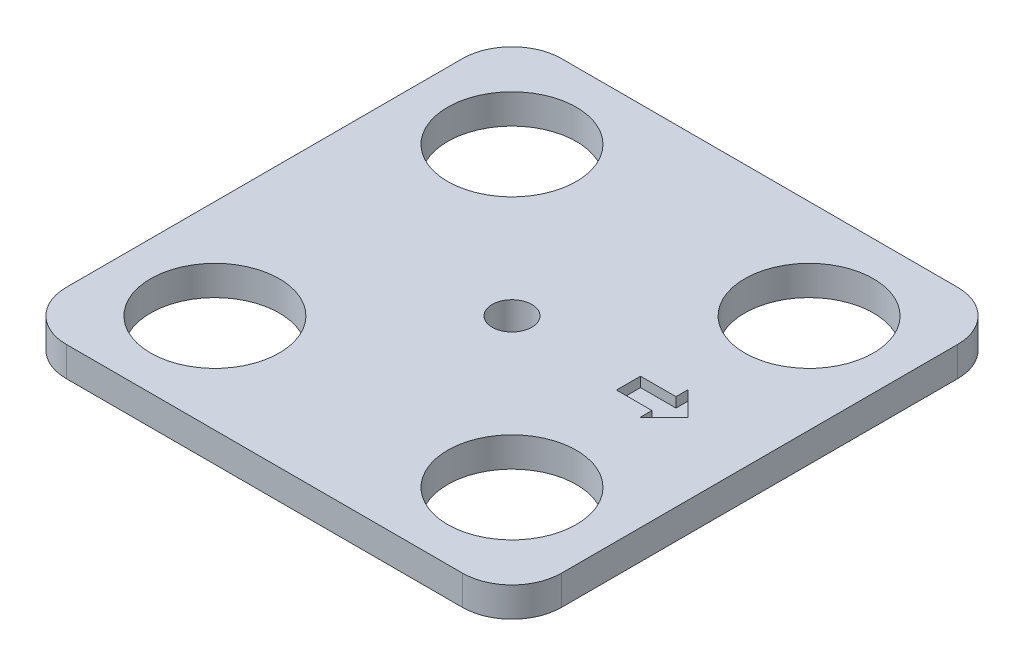
ISO-10303-21;
HEADER;
FILE_DESCRIPTION(('STEP AP214'),'2;1');
FILE_NAME('part.step','',(''),(''),'','','');
FILE_SCHEMA(('AUTOMOTIVE_DESIGN { 1 0 10303 214 1 1 1 1 }'));
ENDSEC;
DATA;
#1=APPLICATION_CONTEXT('core data for automotive mechanical design processes');
#2=APPLICATION_PROTOCOL_DEFINITION('international standard','automotive_design',2000,#1);
#3=PRODUCT_CONTEXT('',#1,'mechanical');
#4=PRODUCT('Part','Part','',(#3));
#5=PRODUCT_RELATED_PRODUCT_CATEGORY('part','',(#4));
#6=PRODUCT_DEFINITION_FORMATION('','',#4);
#7=PRODUCT_DEFINITION_CONTEXT('part definition',#1,'design');
#8=PRODUCT_DEFINITION('design','',#6,#7);
#9=PRODUCT_DEFINITION_SHAPE('','',#8);
#10=(LENGTH_UNIT() NAMED_UNIT(*) SI_UNIT(.MILLI.,.METRE.));
#11=(NAMED_UNIT(*) PLANE_ANGLE_UNIT() SI_UNIT($,.RADIAN.));
#12=(NAMED_UNIT(*) SI_UNIT($,.STERADIAN.) SOLID_ANGLE_UNIT());
#13=UNCERTAINTY_MEASURE_WITH_UNIT(LENGTH_MEASURE(1.E-05),#10,'distance_accuracy_value','');
#14=(GEOMETRIC_REPRESENTATION_CONTEXT(3) GLOBAL_UNCERTAINTY_ASSIGNED_CONTEXT((#13)) GLOBAL_UNIT_ASSIGNED_CONTEXT((#10,
#11,#12)) REPRESENTATION_CONTEXT('',''));
#15=CARTESIAN_POINT('',(0.,0.,0.));
#16=DIRECTION('',(0.,0.,1.));
#17=DIRECTION('',(1.,0.,0.));
#18=AXIS2_PLACEMENT_3D('',#15,#16,#17);
#19=CARTESIAN_POINT('',(-250.,30.,250.));
#20=DIRECTION('',(1.,0.,0.));
#21=DIRECTION('',(0.,0.,-1.));
#22=AXIS2_PLACEMENT_3D('',#19,#20,#21);
#23=PLANE('',#22);
#24=DIRECTION('',(0.,0.,1.));
#25=VECTOR('',#24,1.);
#26=CARTESIAN_POINT('',(-250.,30.,250.));
#27=LINE('',#26,#25);
#28=CARTESIAN_POINT('',(-250.,30.,-200.));
#29=VERTEX_POINT('',#28);
#30=CARTESIAN_POINT('',(-250.,30.,200.));
#31=VERTEX_POINT('',#30);
#32=EDGE_CURVE('E269',#29,#31,#27,.T.);
#33=ORIENTED_EDGE('',*,*,#32,.F.);
#34=DIRECTION('',(0.,-1.,0.));
#35=VECTOR('',#34,1.);
#36=CARTESIAN_POINT('',(-250.,30.,-200.));
#37=LINE('',#36,#35);
#38=CARTESIAN_POINT('',(-250.,0.,-200.));
#39=VERTEX_POINT('',#38);
#40=EDGE_CURVE('E339',#29,#39,#37,.T.);
#41=ORIENTED_EDGE('',*,*,#40,.T.);
#42=DIRECTION('',(0.,0.,1.));
#43=VECTOR('',#42,1.);
#44=CARTESIAN_POINT('',(-250.,0.,250.));
#45=LINE('',#44,#43);
#46=CARTESIAN_POINT('',(-250.,0.,200.));
#47=VERTEX_POINT('',#46);
#48=EDGE_CURVE('E265',#39,#47,#45,.T.);
#49=ORIENTED_EDGE('',*,*,#48,.T.);
#50=DIRECTION('',(0.,-1.,0.));
#51=VECTOR('',#50,1.);
#52=CARTESIAN_POINT('',(-250.,30.,200.));
#53=LINE('',#52,#51);
#54=EDGE_CURVE('E336',#47,#31,#53,.F.);
#55=ORIENTED_EDGE('',*,*,#54,.T.);
#56=EDGE_LOOP('',(#33,#41,#49,#55));
#57=FACE_BOUND('',#56,.T.);
#58=ADVANCED_FACE('F40',(#57),#23,.F.);
#59=CARTESIAN_POINT('',(250.,30.,250.));
#60=DIRECTION('',(0.,0.,-1.));
#61=DIRECTION('',(-1.,0.,0.));
#62=AXIS2_PLACEMENT_3D('',#59,#60,#61);
#63=PLANE('',#62);
#64=DIRECTION('',(1.,0.,0.));
#65=VECTOR('',#64,1.);
#66=CARTESIAN_POINT('',(250.,30.,250.));
#67=LINE('',#66,#65);
#68=CARTESIAN_POINT('',(-200.,30.,250.));
#69=VERTEX_POINT('',#68);
#70=CARTESIAN_POINT('',(200.,30.,250.));
#71=VERTEX_POINT('',#70);
#72=EDGE_CURVE('E273',#69,#71,#67,.T.);
#73=ORIENTED_EDGE('',*,*,#72,.F.);
#74=DIRECTION('',(0.,-1.,0.));
#75=VECTOR('',#74,1.);
#76=CARTESIAN_POINT('',(-200.,30.,250.));
#77=LINE('',#76,#75);
#78=CARTESIAN_POINT('',(-200.,0.,250.));
#79=VERTEX_POINT('',#78);
#80=EDGE_CURVE('E11',#69,#79,#77,.T.);
#81=ORIENTED_EDGE('',*,*,#80,.T.);
#82=DIRECTION('',(1.,0.,0.));
#83=VECTOR('',#82,1.);
#84=CARTESIAN_POINT('',(250.,0.,250.));
#85=LINE('',#84,#83);
#86=CARTESIAN_POINT('',(200.,0.,250.));
#87=VERTEX_POINT('',#86);
#88=EDGE_CURVE('E289',#79,#87,#85,.T.);
#89=ORIENTED_EDGE('',*,*,#88,.T.);
#90=DIRECTION('',(0.,-1.,0.));
#91=VECTOR('',#90,1.);
#92=CARTESIAN_POINT('',(200.,30.,250.));
#93=LINE('',#92,#91);
#94=EDGE_CURVE('E49',#87,#71,#93,.F.);
#95=ORIENTED_EDGE('',*,*,#94,.T.);
#96=EDGE_LOOP('',(#73,#81,#89,#95));
#97=FACE_BOUND('',#96,.T.);
#98=ADVANCED_FACE('F358',(#97),#63,.F.);
#99=CARTESIAN_POINT('',(250.,30.,250.));
#100=DIRECTION('',(-1.,0.,0.));
#101=DIRECTION('',(0.,0.,1.));
#102=AXIS2_PLACEMENT_3D('',#99,#100,#101);
#103=PLANE('',#102);
#104=DIRECTION('',(0.,0.,-1.));
#105=VECTOR('',#104,1.);
#106=CARTESIAN_POINT('',(250.,0.,250.));
#107=LINE('',#106,#105);
#108=CARTESIAN_POINT('',(250.,0.,200.));
#109=VERTEX_POINT('',#108);
#110=CARTESIAN_POINT('',(250.,0.,-200.));
#111=VERTEX_POINT('',#110);
#112=EDGE_CURVE('E292',#109,#111,#107,.T.);
#113=ORIENTED_EDGE('',*,*,#112,.T.);
#114=DIRECTION('',(0.,-1.,0.));
#115=VECTOR('',#114,1.);
#116=CARTESIAN_POINT('',(250.,30.,-200.));
#117=LINE('',#116,#115);
#118=CARTESIAN_POINT('',(250.,30.,-200.));
#119=VERTEX_POINT('',#118);
#120=EDGE_CURVE('E321',#111,#119,#117,.F.);
#121=ORIENTED_EDGE('',*,*,#120,.T.);
#122=DIRECTION('',(0.,0.,-1.));
#123=VECTOR('',#122,1.);
#124=CARTESIAN_POINT('',(250.,30.,250.));
#125=LINE('',#124,#123);
#126=CARTESIAN_POINT('',(250.,30.,200.));
#127=VERTEX_POINT('',#126);
#128=EDGE_CURVE('E277',#127,#119,#125,.T.);
#129=ORIENTED_EDGE('',*,*,#128,.F.);
#130=DIRECTION('',(0.,-1.,0.));
#131=VECTOR('',#130,1.);
#132=CARTESIAN_POINT('',(250.,30.,200.));
#133=LINE('',#132,#131);
#134=EDGE_CURVE('E317',#127,#109,#133,.T.);
#135=ORIENTED_EDGE('',*,*,#134,.T.);
#136=EDGE_LOOP('',(#113,#121,#129,#135));
#137=FACE_BOUND('',#136,.T.);
#138=ADVANCED_FACE('F367',(#137),#103,.F.);
#139=CARTESIAN_POINT('',(250.,30.,-250.));
#140=DIRECTION('',(0.,0.,1.));
#141=DIRECTION('',(1.,0.,0.));
#142=AXIS2_PLACEMENT_3D('',#139,#140,#141);
#143=PLANE('',#142);
#144=DIRECTION('',(-1.,0.,0.));
#145=VECTOR('',#144,1.);
#146=CARTESIAN_POINT('',(250.,30.,-250.));
#147=LINE('',#146,#145);
#148=CARTESIAN_POINT('',(200.,30.,-250.));
#149=VERTEX_POINT('',#148);
#150=CARTESIAN_POINT('',(-200.,30.,-250.));
#151=VERTEX_POINT('',#150);
#152=EDGE_CURVE('E281',#149,#151,#147,.T.);
#153=ORIENTED_EDGE('',*,*,#152,.F.);
#154=DIRECTION('',(0.,-1.,0.));
#155=VECTOR('',#154,1.);
#156=CARTESIAN_POINT('',(200.,30.,-250.));
#157=LINE('',#156,#155);
#158=CARTESIAN_POINT('',(200.,0.,-250.));
#159=VERTEX_POINT('',#158);
#160=EDGE_CURVE('E301',#149,#159,#157,.T.);
#161=ORIENTED_EDGE('',*,*,#160,.T.);
#162=DIRECTION('',(-1.,0.,0.));
#163=VECTOR('',#162,1.);
#164=CARTESIAN_POINT('',(250.,0.,-250.));
#165=LINE('',#164,#163);
#166=CARTESIAN_POINT('',(-200.,0.,-250.));
#167=VERTEX_POINT('',#166);
#168=EDGE_CURVE('E274',#159,#167,#165,.T.);
#169=ORIENTED_EDGE('',*,*,#168,.T.);
#170=DIRECTION('',(0.,-1.,0.));
#171=VECTOR('',#170,1.);
#172=CARTESIAN_POINT('',(-200.,30.,-250.));
#173=LINE('',#172,#171);
#174=EDGE_CURVE('E285',#167,#151,#173,.F.);
#175=ORIENTED_EDGE('',*,*,#174,.T.);
#176=EDGE_LOOP('',(#153,#161,#169,#175));
#177=FACE_BOUND('',#176,.T.);
#178=ADVANCED_FACE('F375',(#177),#143,.F.);
#179=CARTESIAN_POINT('',(0.,30.,0.));
#180=DIRECTION('',(0.,1.,0.));
#181=DIRECTION('',(0.,0.,1.));
#182=AXIS2_PLACEMENT_3D('',#179,#180,#181);
#183=PLANE('',#182);
#184=CARTESIAN_POINT('',(0.,30.,0.));
#185=DIRECTION('',(0.,1.,0.));
#186=DIRECTION('',(0.,0.,1.));
#187=AXIS2_PLACEMENT_3D('',#184,#185,#186);
#188=CIRCLE('',#187,20.);
#189=CARTESIAN_POINT('',(0.,30.,20.));
#190=VERTEX_POINT('',#189);
#191=EDGE_CURVE('E180',#190,#190,#188,.T.);
#192=ORIENTED_EDGE('',*,*,#191,.F.);
#193=EDGE_LOOP('',(#192));
#194=FACE_BOUND('',#193,.T.);
#195=DIRECTION('',(0.707106781186551,0.,-0.707106781186544));
#196=VECTOR('',#195,1.);
#197=CARTESIAN_POINT('',(177.720371549238,30.,0.));
#198=LINE('',#197,#196);
#199=CARTESIAN_POINT('',(153.455288688315,30.,24.2650828609228));
#200=VERTEX_POINT('',#199);
#201=CARTESIAN_POINT('',(177.720371549238,30.,0.));
#202=VERTEX_POINT('',#201);
#203=EDGE_CURVE('E56',#200,#202,#198,.T.);
#204=ORIENTED_EDGE('',*,*,#203,.F.);
#205=DIRECTION('',(0.,0.,1.));
#206=VECTOR('',#205,1.);
#207=CARTESIAN_POINT('',(153.455288688315,30.,24.2650828609228));
#208=LINE('',#207,#206);
#209=CARTESIAN_POINT('',(153.455288688315,30.,12.1325414304614));
#210=VERTEX_POINT('',#209);
#211=EDGE_CURVE('E173',#210,#200,#208,.T.);
#212=ORIENTED_EDGE('',*,*,#211,.F.);
#213=DIRECTION('',(1.,0.,0.));
#214=VECTOR('',#213,1.);
#215=CARTESIAN_POINT('',(153.455288688315,30.,12.1325414304614));
#216=LINE('',#215,#214);
#217=CARTESIAN_POINT('',(117.643810745868,30.,12.1325414304614));
#218=VERTEX_POINT('',#217);
#219=EDGE_CURVE('E177',#218,#210,#216,.T.);
#220=ORIENTED_EDGE('',*,*,#219,.F.);
#221=DIRECTION('',(0.,0.,1.));
#222=VECTOR('',#221,1.);
#223=CARTESIAN_POINT('',(117.643810745868,30.,-12.1325414304614));
#224=LINE('',#223,#222);
#225=CARTESIAN_POINT('',(117.643810745868,30.,-12.1325414304614));
#226=VERTEX_POINT('',#225);
#227=EDGE_CURVE('E212',#226,#218,#224,.T.);
#228=ORIENTED_EDGE('',*,*,#227,.F.);
#229=DIRECTION('',(-1.,0.,0.));
#230=VECTOR('',#229,1.);
#231=CARTESIAN_POINT('',(153.455288688315,30.,-12.1325414304614));
#232=LINE('',#231,#230);
#233=CARTESIAN_POINT('',(153.455288688315,30.,-12.1325414304614));
#234=VERTEX_POINT('',#233);
#235=EDGE_CURVE('E208',#234,#226,#232,.T.);
#236=ORIENTED_EDGE('',*,*,#235,.F.);
#237=DIRECTION('',(0.,0.,1.));
#238=VECTOR('',#237,1.);
#239=CARTESIAN_POINT('',(153.455288688315,30.,-24.2650828609228));
#240=LINE('',#239,#238);
#241=CARTESIAN_POINT('',(153.455288688315,30.,-24.2650828609228));
#242=VERTEX_POINT('',#241);
#243=EDGE_CURVE('E204',#242,#234,#240,.T.);
#244=ORIENTED_EDGE('',*,*,#243,.F.);
#245=DIRECTION('',(-0.707106781186551,0.,-0.707106781186544));
#246=VECTOR('',#245,1.);
#247=CARTESIAN_POINT('',(177.720371549238,30.,0.));
#248=LINE('',#247,#246);
#249=EDGE_CURVE('E200',#202,#242,#248,.T.);
#250=ORIENTED_EDGE('',*,*,#249,.F.);
#251=EDGE_LOOP('',(#204,#212,#220,#228,#236,#244,#250));
#252=FACE_BOUND('',#251,.T.);
#253=CARTESIAN_POINT('',(-150.,30.,150.));
#254=DIRECTION('',(0.,1.,0.));
#255=DIRECTION('',(0.,0.,1.));
#256=AXIS2_PLACEMENT_3D('',#253,#254,#255);
#257=CIRCLE('',#256,65.);
#258=CARTESIAN_POINT('',(-150.,30.,215.));
#259=VERTEX_POINT('',#258);
#260=EDGE_CURVE('E250',#259,#259,#257,.T.);
#261=ORIENTED_EDGE('',*,*,#260,.F.);
#262=EDGE_LOOP('',(#261));
#263=FACE_BOUND('',#262,.T.);
#264=CARTESIAN_POINT('',(150.,30.,-150.));
#265=DIRECTION('',(0.,1.,0.));
#266=DIRECTION('',(0.,0.,1.));
#267=AXIS2_PLACEMENT_3D('',#264,#265,#266);
#268=CIRCLE('',#267,65.);
#269=CARTESIAN_POINT('',(150.,30.,-85.));
#270=VERTEX_POINT('',#269);
#271=EDGE_CURVE('E241',#270,#270,#268,.T.);
#272=ORIENTED_EDGE('',*,*,#271,.F.);
#273=EDGE_LOOP('',(#272));
#274=FACE_BOUND('',#273,.T.);
#275=CARTESIAN_POINT('',(-150.,30.,-150.));
#276=DIRECTION('',(0.,1.,0.));
#277=DIRECTION('',(0.,0.,1.));
#278=AXIS2_PLACEMENT_3D('',#275,#276,#277);
#279=CIRCLE('',#278,65.);
#280=CARTESIAN_POINT('',(-150.,30.,-85.));
#281=VERTEX_POINT('',#280);
#282=EDGE_CURVE('E222',#281,#281,#279,.T.);
#283=ORIENTED_EDGE('',*,*,#282,.F.);
#284=EDGE_LOOP('',(#283));
#285=FACE_BOUND('',#284,.T.);
#286=CARTESIAN_POINT('',(150.,30.,150.));
#287=DIRECTION('',(0.,1.,0.));
#288=DIRECTION('',(0.,0.,1.));
#289=AXIS2_PLACEMENT_3D('',#286,#287,#288);
#290=CIRCLE('',#289,65.0000000000001);
#291=CARTESIAN_POINT('',(150.,30.,215.));
#292=VERTEX_POINT('',#291);
#293=EDGE_CURVE('E249',#292,#292,#290,.T.);
#294=ORIENTED_EDGE('',*,*,#293,.F.);
#295=EDGE_LOOP('',(#294));
#296=FACE_BOUND('',#295,.T.);
#297=ORIENTED_EDGE('',*,*,#128,.T.);
#298=CARTESIAN_POINT('',(200.,30.,-200.));
#299=DIRECTION('',(0.,1.,0.));
#300=DIRECTION('',(0.,0.,1.));
#301=AXIS2_PLACEMENT_3D('',#298,#299,#300);
#302=CIRCLE('',#301,50.);
#303=EDGE_CURVE('E333',#119,#149,#302,.T.);
#304=ORIENTED_EDGE('',*,*,#303,.T.);
#305=ORIENTED_EDGE('',*,*,#152,.T.);
#306=CARTESIAN_POINT('',(-200.,30.,-200.));
#307=DIRECTION('',(0.,1.,0.));
#308=DIRECTION('',(0.,0.,1.));
#309=AXIS2_PLACEMENT_3D('',#306,#307,#308);
#310=CIRCLE('',#309,50.);
#311=EDGE_CURVE('E330',#151,#29,#310,.T.);
#312=ORIENTED_EDGE('',*,*,#311,.T.);
#313=ORIENTED_EDGE('',*,*,#32,.T.);
#314=CARTESIAN_POINT('',(-200.,30.,200.));
#315=DIRECTION('',(0.,1.,0.));
#316=DIRECTION('',(0.,0.,1.));
#317=AXIS2_PLACEMENT_3D('',#314,#315,#316);
#318=CIRCLE('',#317,50.);
#319=EDGE_CURVE('E327',#31,#69,#318,.T.);
#320=ORIENTED_EDGE('',*,*,#319,.T.);
#321=ORIENTED_EDGE('',*,*,#72,.T.);
#322=CARTESIAN_POINT('',(200.,30.,200.));
#323=DIRECTION('',(0.,1.,0.));
#324=DIRECTION('',(0.,0.,1.));
#325=AXIS2_PLACEMENT_3D('',#322,#323,#324);
#326=CIRCLE('',#325,50.);
#327=EDGE_CURVE('E324',#71,#127,#326,.T.);
#328=ORIENTED_EDGE('',*,*,#327,.T.);
#329=EDGE_LOOP('',(#297,#304,#305,#312,#313,#320,#321,#328));
#330=FACE_BOUND('',#329,.T.);
#331=ADVANCED_FACE('F361',(#194,#252,#263,#274,#285,#296,#330),#183,.T.);
#332=CARTESIAN_POINT('',(0.,0.,0.));
#333=DIRECTION('',(0.,1.,0.));
#334=DIRECTION('',(0.,0.,1.));
#335=AXIS2_PLACEMENT_3D('',#332,#333,#334);
#336=PLANE('',#335);
#337=CARTESIAN_POINT('',(0.,0.,0.));
#338=DIRECTION('',(0.,1.,0.));
#339=DIRECTION('',(0.,0.,1.));
#340=AXIS2_PLACEMENT_3D('',#337,#338,#339);
#341=CIRCLE('',#340,20.);
#342=CARTESIAN_POINT('',(0.,0.,20.));
#343=VERTEX_POINT('',#342);
#344=EDGE_CURVE('E201',#343,#343,#341,.T.);
#345=ORIENTED_EDGE('',*,*,#344,.T.);
#346=EDGE_LOOP('',(#345));
#347=FACE_BOUND('',#346,.T.);
#348=CARTESIAN_POINT('',(-150.,0.,150.));
#349=DIRECTION('',(0.,1.,0.));
#350=DIRECTION('',(0.,0.,1.));
#351=AXIS2_PLACEMENT_3D('',#348,#349,#350);
#352=CIRCLE('',#351,65.);
#353=CARTESIAN_POINT('',(-150.,0.,215.));
#354=VERTEX_POINT('',#353);
#355=EDGE_CURVE('E245',#354,#354,#352,.T.);
#356=ORIENTED_EDGE('',*,*,#355,.T.);
#357=EDGE_LOOP('',(#356));
#358=FACE_BOUND('',#357,.T.);
#359=CARTESIAN_POINT('',(150.,0.,-150.));
#360=DIRECTION('',(0.,1.,0.));
#361=DIRECTION('',(0.,0.,1.));
#362=AXIS2_PLACEMENT_3D('',#359,#360,#361);
#363=CIRCLE('',#362,65.);
#364=CARTESIAN_POINT('',(150.,0.,-85.));
#365=VERTEX_POINT('',#364);
#366=EDGE_CURVE('E254',#365,#365,#363,.T.);
#367=ORIENTED_EDGE('',*,*,#366,.T.);
#368=EDGE_LOOP('',(#367));
#369=FACE_BOUND('',#368,.T.);
#370=CARTESIAN_POINT('',(-150.,0.,-150.));
#371=DIRECTION('',(0.,1.,0.));
#372=DIRECTION('',(0.,0.,1.));
#373=AXIS2_PLACEMENT_3D('',#370,#371,#372);
#374=CIRCLE('',#373,65.);
#375=CARTESIAN_POINT('',(-150.,0.,-85.));
#376=VERTEX_POINT('',#375);
#377=EDGE_CURVE('E237',#376,#376,#374,.T.);
#378=ORIENTED_EDGE('',*,*,#377,.T.);
#379=EDGE_LOOP('',(#378));
#380=FACE_BOUND('',#379,.T.);
#381=CARTESIAN_POINT('',(150.,0.,150.));
#382=DIRECTION('',(0.,1.,0.));
#383=DIRECTION('',(0.,0.,1.));
#384=AXIS2_PLACEMENT_3D('',#381,#382,#383);
#385=CIRCLE('',#384,65.0000000000001);
#386=CARTESIAN_POINT('',(150.,0.,215.));
#387=VERTEX_POINT('',#386);
#388=EDGE_CURVE('E261',#387,#387,#385,.T.);
#389=ORIENTED_EDGE('',*,*,#388,.T.);
#390=EDGE_LOOP('',(#389));
#391=FACE_BOUND('',#390,.T.);
#392=ORIENTED_EDGE('',*,*,#168,.F.);
#393=CARTESIAN_POINT('',(200.,0.,-200.));
#394=DIRECTION('',(0.,1.,0.));
#395=DIRECTION('',(0.,0.,1.));
#396=AXIS2_PLACEMENT_3D('',#393,#394,#395);
#397=CIRCLE('',#396,50.);
#398=EDGE_CURVE('E314',#159,#111,#397,.F.);
#399=ORIENTED_EDGE('',*,*,#398,.T.);
#400=ORIENTED_EDGE('',*,*,#112,.F.);
#401=CARTESIAN_POINT('',(200.,0.,200.));
#402=DIRECTION('',(0.,1.,0.));
#403=DIRECTION('',(0.,0.,1.));
#404=AXIS2_PLACEMENT_3D('',#401,#402,#403);
#405=CIRCLE('',#404,50.);
#406=EDGE_CURVE('E305',#109,#87,#405,.F.);
#407=ORIENTED_EDGE('',*,*,#406,.T.);
#408=ORIENTED_EDGE('',*,*,#88,.F.);
#409=CARTESIAN_POINT('',(-200.,0.,200.));
#410=DIRECTION('',(0.,1.,0.));
#411=DIRECTION('',(0.,0.,1.));
#412=AXIS2_PLACEMENT_3D('',#409,#410,#411);
#413=CIRCLE('',#412,50.);
#414=EDGE_CURVE('E308',#79,#47,#413,.F.);
#415=ORIENTED_EDGE('',*,*,#414,.T.);
#416=ORIENTED_EDGE('',*,*,#48,.F.);
#417=CARTESIAN_POINT('',(-200.,0.,-200.));
#418=DIRECTION('',(0.,1.,0.));
#419=DIRECTION('',(0.,0.,1.));
#420=AXIS2_PLACEMENT_3D('',#417,#418,#419);
#421=CIRCLE('',#420,50.);
#422=EDGE_CURVE('E311',#39,#167,#421,.F.);
#423=ORIENTED_EDGE('',*,*,#422,.T.);
#424=EDGE_LOOP('',(#392,#399,#400,#407,#408,#415,#416,#423));
#425=FACE_BOUND('',#424,.T.);
#426=ADVANCED_FACE('F352',(#347,#358,#369,#380,#391,#425),#336,.F.);
#427=CARTESIAN_POINT('',(150.,0.,150.));
#428=DIRECTION('',(0.,1.,0.));
#429=DIRECTION('',(0.,0.,1.));
#430=AXIS2_PLACEMENT_3D('',#427,#428,#429);
#431=CYLINDRICAL_SURFACE('',#430,65.0000000000001);
#432=ORIENTED_EDGE('',*,*,#388,.F.);
#433=EDGE_LOOP('',(#432));
#434=FACE_BOUND('',#433,.T.);
#435=ORIENTED_EDGE('',*,*,#293,.T.);
#436=EDGE_LOOP('',(#435));
#437=FACE_BOUND('',#436,.T.);
#438=ADVANCED_FACE('F399',(#434,#437),#431,.F.);
#439=CARTESIAN_POINT('',(-150.,0.,-150.));
#440=DIRECTION('',(0.,1.,0.));
#441=DIRECTION('',(0.,0.,1.));
#442=AXIS2_PLACEMENT_3D('',#439,#440,#441);
#443=CYLINDRICAL_SURFACE('',#442,65.);
#444=ORIENTED_EDGE('',*,*,#377,.F.);
#445=EDGE_LOOP('',(#444));
#446=FACE_BOUND('',#445,.T.);
#447=ORIENTED_EDGE('',*,*,#282,.T.);
#448=EDGE_LOOP('',(#447));
#449=FACE_BOUND('',#448,.T.);
#450=ADVANCED_FACE('F406',(#446,#449),#443,.F.);
#451=CARTESIAN_POINT('',(150.,0.,-150.));
#452=DIRECTION('',(0.,1.,0.));
#453=DIRECTION('',(0.,0.,1.));
#454=AXIS2_PLACEMENT_3D('',#451,#452,#453);
#455=CYLINDRICAL_SURFACE('',#454,65.);
#456=ORIENTED_EDGE('',*,*,#366,.F.);
#457=EDGE_LOOP('',(#456));
#458=FACE_BOUND('',#457,.T.);
#459=ORIENTED_EDGE('',*,*,#271,.T.);
#460=EDGE_LOOP('',(#459));
#461=FACE_BOUND('',#460,.T.);
#462=ADVANCED_FACE('F408',(#458,#461),#455,.F.);
#463=CARTESIAN_POINT('',(-150.,0.,150.));
#464=DIRECTION('',(0.,1.,0.));
#465=DIRECTION('',(0.,0.,1.));
#466=AXIS2_PLACEMENT_3D('',#463,#464,#465);
#467=CYLINDRICAL_SURFACE('',#466,65.);
#468=ORIENTED_EDGE('',*,*,#355,.F.);
#469=EDGE_LOOP('',(#468));
#470=FACE_BOUND('',#469,.T.);
#471=ORIENTED_EDGE('',*,*,#260,.T.);
#472=EDGE_LOOP('',(#471));
#473=FACE_BOUND('',#472,.T.);
#474=ADVANCED_FACE('F384',(#470,#473),#467,.F.);
#475=CARTESIAN_POINT('',(200.,30.,-200.));
#476=DIRECTION('',(0.,-1.,0.));
#477=DIRECTION('',(0.,0.,-1.));
#478=AXIS2_PLACEMENT_3D('',#475,#476,#477);
#479=CYLINDRICAL_SURFACE('',#478,50.);
#480=ORIENTED_EDGE('',*,*,#303,.F.);
#481=ORIENTED_EDGE('',*,*,#120,.F.);
#482=ORIENTED_EDGE('',*,*,#398,.F.);
#483=ORIENTED_EDGE('',*,*,#160,.F.);
#484=EDGE_LOOP('',(#480,#481,#482,#483));
#485=FACE_BOUND('',#484,.T.);
#486=ADVANCED_FACE('F372',(#485),#479,.T.);
#487=CARTESIAN_POINT('',(-200.,30.,-200.));
#488=DIRECTION('',(0.,-1.,0.));
#489=DIRECTION('',(0.,0.,-1.));
#490=AXIS2_PLACEMENT_3D('',#487,#488,#489);
#491=CYLINDRICAL_SURFACE('',#490,50.);
#492=ORIENTED_EDGE('',*,*,#311,.F.);
#493=ORIENTED_EDGE('',*,*,#174,.F.);
#494=ORIENTED_EDGE('',*,*,#422,.F.);
#495=ORIENTED_EDGE('',*,*,#40,.F.);
#496=EDGE_LOOP('',(#492,#493,#494,#495));
#497=FACE_BOUND('',#496,.T.);
#498=ADVANCED_FACE('F377',(#497),#491,.T.);
#499=CARTESIAN_POINT('',(-200.,30.,200.));
#500=DIRECTION('',(0.,-1.,0.));
#501=DIRECTION('',(0.,0.,-1.));
#502=AXIS2_PLACEMENT_3D('',#499,#500,#501);
#503=CYLINDRICAL_SURFACE('',#502,50.);
#504=ORIENTED_EDGE('',*,*,#319,.F.);
#505=ORIENTED_EDGE('',*,*,#54,.F.);
#506=ORIENTED_EDGE('',*,*,#414,.F.);
#507=ORIENTED_EDGE('',*,*,#80,.F.);
#508=EDGE_LOOP('',(#504,#505,#506,#507));
#509=FACE_BOUND('',#508,.T.);
#510=ADVANCED_FACE('F357',(#509),#503,.T.);
#511=CARTESIAN_POINT('',(200.,30.,200.));
#512=DIRECTION('',(0.,-1.,0.));
#513=DIRECTION('',(0.,0.,-1.));
#514=AXIS2_PLACEMENT_3D('',#511,#512,#513);
#515=CYLINDRICAL_SURFACE('',#514,50.);
#516=ORIENTED_EDGE('',*,*,#327,.F.);
#517=ORIENTED_EDGE('',*,*,#94,.F.);
#518=ORIENTED_EDGE('',*,*,#406,.F.);
#519=ORIENTED_EDGE('',*,*,#134,.F.);
#520=EDGE_LOOP('',(#516,#517,#518,#519));
#521=FACE_BOUND('',#520,.T.);
#522=ADVANCED_FACE('F42',(#521),#515,.T.);
#523=CARTESIAN_POINT('',(177.720371549238,20.,0.));
#524=DIRECTION('',(0.707106781186544,0.,0.707106781186551));
#525=DIRECTION('',(0.707106781186551,0.,-0.707106781186544));
#526=AXIS2_PLACEMENT_3D('',#523,#524,#525);
#527=PLANE('',#526);
#528=ORIENTED_EDGE('',*,*,#203,.T.);
#529=DIRECTION('',(0.,1.,0.));
#530=VECTOR('',#529,1.);
#531=CARTESIAN_POINT('',(177.720371549238,20.,0.));
#532=LINE('',#531,#530);
#533=CARTESIAN_POINT('',(177.720371549238,20.,0.));
#534=VERTEX_POINT('',#533);
#535=EDGE_CURVE('E147',#534,#202,#532,.T.);
#536=ORIENTED_EDGE('',*,*,#535,.F.);
#537=DIRECTION('',(0.707106781186551,0.,-0.707106781186544));
#538=VECTOR('',#537,1.);
#539=CARTESIAN_POINT('',(177.720371549238,20.,0.));
#540=LINE('',#539,#538);
#541=CARTESIAN_POINT('',(153.455288688315,20.,24.2650828609228));
#542=VERTEX_POINT('',#541);
#543=EDGE_CURVE('E151',#542,#534,#540,.T.);
#544=ORIENTED_EDGE('',*,*,#543,.F.);
#545=DIRECTION('',(0.,1.,0.));
#546=VECTOR('',#545,1.);
#547=CARTESIAN_POINT('',(153.455288688315,20.,24.2650828609228));
#548=LINE('',#547,#546);
#549=EDGE_CURVE('E219',#542,#200,#548,.T.);
#550=ORIENTED_EDGE('',*,*,#549,.T.);
#551=EDGE_LOOP('',(#528,#536,#544,#550));
#552=FACE_BOUND('',#551,.T.);
#553=ADVANCED_FACE('F149',(#552),#527,.F.);
#554=CARTESIAN_POINT('',(153.455288688315,20.,24.2650828609228));
#555=DIRECTION('',(-1.,0.,0.));
#556=DIRECTION('',(0.,0.,1.));
#557=AXIS2_PLACEMENT_3D('',#554,#555,#556);
#558=PLANE('',#557);
#559=ORIENTED_EDGE('',*,*,#211,.T.);
#560=ORIENTED_EDGE('',*,*,#549,.F.);
#561=DIRECTION('',(0.,0.,1.));
#562=VECTOR('',#561,1.);
#563=CARTESIAN_POINT('',(153.455288688315,20.,24.2650828609228));
#564=LINE('',#563,#562);
#565=CARTESIAN_POINT('',(153.455288688315,20.,12.1325414304614));
#566=VERTEX_POINT('',#565);
#567=EDGE_CURVE('E158',#566,#542,#564,.T.);
#568=ORIENTED_EDGE('',*,*,#567,.F.);
#569=DIRECTION('',(0.,1.,0.));
#570=VECTOR('',#569,1.);
#571=CARTESIAN_POINT('',(153.455288688315,20.,12.1325414304614));
#572=LINE('',#571,#570);
#573=EDGE_CURVE('E223',#566,#210,#572,.T.);
#574=ORIENTED_EDGE('',*,*,#573,.T.);
#575=EDGE_LOOP('',(#559,#560,#568,#574));
#576=FACE_BOUND('',#575,.T.);
#577=ADVANCED_FACE('F420',(#576),#558,.F.);
#578=CARTESIAN_POINT('',(153.455288688315,20.,12.1325414304614));
#579=DIRECTION('',(0.,0.,1.));
#580=DIRECTION('',(1.,0.,0.));
#581=AXIS2_PLACEMENT_3D('',#578,#579,#580);
#582=PLANE('',#581);
#583=ORIENTED_EDGE('',*,*,#219,.T.);
#584=ORIENTED_EDGE('',*,*,#573,.F.);
#585=DIRECTION('',(1.,0.,0.));
#586=VECTOR('',#585,1.);
#587=CARTESIAN_POINT('',(153.455288688315,20.,12.1325414304614));
#588=LINE('',#587,#586);
#589=CARTESIAN_POINT('',(117.643810745868,20.,12.1325414304614));
#590=VERTEX_POINT('',#589);
#591=EDGE_CURVE('E193',#590,#566,#588,.T.);
#592=ORIENTED_EDGE('',*,*,#591,.F.);
#593=DIRECTION('',(0.,1.,0.));
#594=VECTOR('',#593,1.);
#595=CARTESIAN_POINT('',(117.643810745868,20.,12.1325414304614));
#596=LINE('',#595,#594);
#597=EDGE_CURVE('E226',#590,#218,#596,.T.);
#598=ORIENTED_EDGE('',*,*,#597,.T.);
#599=EDGE_LOOP('',(#583,#584,#592,#598));
#600=FACE_BOUND('',#599,.T.);
#601=ADVANCED_FACE('F434',(#600),#582,.F.);
#602=CARTESIAN_POINT('',(117.643810745868,20.,-12.1325414304614));
#603=DIRECTION('',(-1.,0.,0.));
#604=DIRECTION('',(0.,0.,1.));
#605=AXIS2_PLACEMENT_3D('',#602,#603,#604);
#606=PLANE('',#605);
#607=ORIENTED_EDGE('',*,*,#227,.T.);
#608=ORIENTED_EDGE('',*,*,#597,.F.);
#609=DIRECTION('',(0.,0.,1.));
#610=VECTOR('',#609,1.);
#611=CARTESIAN_POINT('',(117.643810745868,20.,-12.1325414304614));
#612=LINE('',#611,#610);
#613=CARTESIAN_POINT('',(117.643810745868,20.,-12.1325414304614));
#614=VERTEX_POINT('',#613);
#615=EDGE_CURVE('E189',#614,#590,#612,.T.);
#616=ORIENTED_EDGE('',*,*,#615,.F.);
#617=DIRECTION('',(0.,1.,0.));
#618=VECTOR('',#617,1.);
#619=CARTESIAN_POINT('',(117.643810745868,20.,-12.1325414304614));
#620=LINE('',#619,#618);
#621=EDGE_CURVE('E229',#614,#226,#620,.T.);
#622=ORIENTED_EDGE('',*,*,#621,.T.);
#623=EDGE_LOOP('',(#607,#608,#616,#622));
#624=FACE_BOUND('',#623,.T.);
#625=ADVANCED_FACE('F430',(#624),#606,.F.);
#626=CARTESIAN_POINT('',(153.455288688315,20.,-12.1325414304614));
#627=DIRECTION('',(0.,0.,-1.));
#628=DIRECTION('',(-1.,0.,0.));
#629=AXIS2_PLACEMENT_3D('',#626,#627,#628);
#630=PLANE('',#629);
#631=ORIENTED_EDGE('',*,*,#235,.T.);
#632=ORIENTED_EDGE('',*,*,#621,.F.);
#633=DIRECTION('',(-1.,0.,0.));
#634=VECTOR('',#633,1.);
#635=CARTESIAN_POINT('',(153.455288688315,20.,-12.1325414304614));
#636=LINE('',#635,#634);
#637=CARTESIAN_POINT('',(153.455288688315,20.,-12.1325414304614));
#638=VERTEX_POINT('',#637);
#639=EDGE_CURVE('E185',#638,#614,#636,.T.);
#640=ORIENTED_EDGE('',*,*,#639,.F.);
#641=DIRECTION('',(0.,1.,0.));
#642=VECTOR('',#641,1.);
#643=CARTESIAN_POINT('',(153.455288688315,20.,-12.1325414304614));
#644=LINE('',#643,#642);
#645=EDGE_CURVE('E232',#638,#234,#644,.T.);
#646=ORIENTED_EDGE('',*,*,#645,.T.);
#647=EDGE_LOOP('',(#631,#632,#640,#646));
#648=FACE_BOUND('',#647,.T.);
#649=ADVANCED_FACE('F426',(#648),#630,.F.);
#650=CARTESIAN_POINT('',(153.455288688315,20.,-24.2650828609228));
#651=DIRECTION('',(-1.,0.,0.));
#652=DIRECTION('',(0.,0.,1.));
#653=AXIS2_PLACEMENT_3D('',#650,#651,#652);
#654=PLANE('',#653);
#655=ORIENTED_EDGE('',*,*,#243,.T.);
#656=ORIENTED_EDGE('',*,*,#645,.F.);
#657=DIRECTION('',(0.,0.,1.));
#658=VECTOR('',#657,1.);
#659=CARTESIAN_POINT('',(153.455288688315,20.,-24.2650828609228));
#660=LINE('',#659,#658);
#661=CARTESIAN_POINT('',(153.455288688315,20.,-24.2650828609228));
#662=VERTEX_POINT('',#661);
#663=EDGE_CURVE('E167',#662,#638,#660,.T.);
#664=ORIENTED_EDGE('',*,*,#663,.F.);
#665=DIRECTION('',(0.,1.,0.));
#666=VECTOR('',#665,1.);
#667=CARTESIAN_POINT('',(153.455288688315,20.,-24.2650828609228));
#668=LINE('',#667,#666);
#669=EDGE_CURVE('E157',#662,#242,#668,.T.);
#670=ORIENTED_EDGE('',*,*,#669,.T.);
#671=EDGE_LOOP('',(#655,#656,#664,#670));
#672=FACE_BOUND('',#671,.T.);
#673=ADVANCED_FACE('F423',(#672),#654,.F.);
#674=CARTESIAN_POINT('',(177.720371549238,20.,0.));
#675=DIRECTION('',(0.707106781186544,0.,-0.707106781186551));
#676=DIRECTION('',(-0.707106781186551,0.,-0.707106781186544));
#677=AXIS2_PLACEMENT_3D('',#674,#675,#676);
#678=PLANE('',#677);
#679=ORIENTED_EDGE('',*,*,#249,.T.);
#680=ORIENTED_EDGE('',*,*,#669,.F.);
#681=DIRECTION('',(-0.707106781186551,0.,-0.707106781186544));
#682=VECTOR('',#681,1.);
#683=CARTESIAN_POINT('',(177.720371549238,20.,0.));
#684=LINE('',#683,#682);
#685=EDGE_CURVE('E161',#534,#662,#684,.T.);
#686=ORIENTED_EDGE('',*,*,#685,.F.);
#687=ORIENTED_EDGE('',*,*,#535,.T.);
#688=EDGE_LOOP('',(#679,#680,#686,#687));
#689=FACE_BOUND('',#688,.T.);
#690=ADVANCED_FACE('F162',(#689),#678,.F.);
#691=CARTESIAN_POINT('',(0.,20.,0.));
#692=DIRECTION('',(0.,-1.,0.));
#693=DIRECTION('',(0.,0.,-1.));
#694=AXIS2_PLACEMENT_3D('',#691,#692,#693);
#695=PLANE('',#694);
#696=ORIENTED_EDGE('',*,*,#543,.T.);
#697=ORIENTED_EDGE('',*,*,#685,.T.);
#698=ORIENTED_EDGE('',*,*,#663,.T.);
#699=ORIENTED_EDGE('',*,*,#639,.T.);
#700=ORIENTED_EDGE('',*,*,#615,.T.);
#701=ORIENTED_EDGE('',*,*,#591,.T.);
#702=ORIENTED_EDGE('',*,*,#567,.T.);
#703=EDGE_LOOP('',(#696,#697,#698,#699,#700,#701,#702));
#704=FACE_BOUND('',#703,.T.);
#705=ADVANCED_FACE('F169',(#704),#695,.F.);
#706=CARTESIAN_POINT('',(0.,0.,0.));
#707=DIRECTION('',(0.,1.,0.));
#708=DIRECTION('',(0.,0.,1.));
#709=AXIS2_PLACEMENT_3D('',#706,#707,#708);
#710=CYLINDRICAL_SURFACE('',#709,20.);
#711=ORIENTED_EDGE('',*,*,#344,.F.);
#712=EDGE_LOOP('',(#711));
#713=FACE_BOUND('',#712,.T.);
#714=ORIENTED_EDGE('',*,*,#191,.T.);
#715=EDGE_LOOP('',(#714));
#716=FACE_BOUND('',#715,.T.);
#717=ADVANCED_FACE('F444',(#713,#716),#710,.F.);
#718=CLOSED_SHELL('',(#58,#98,#138,#178,#331,#426,#438,#450,#462,#474,#486,#498,#510,#522,#553,
#577,#601,#625,#649,#673,#690,#705,#717));
#719=MANIFOLD_SOLID_BREP('B2',#718);
#720=ADVANCED_BREP_SHAPE_REPRESENTATION('',(#18,#719),#14);
#721=SHAPE_DEFINITION_REPRESENTATION(#9,#720);
ENDSEC;
END-ISO-10303-21;
